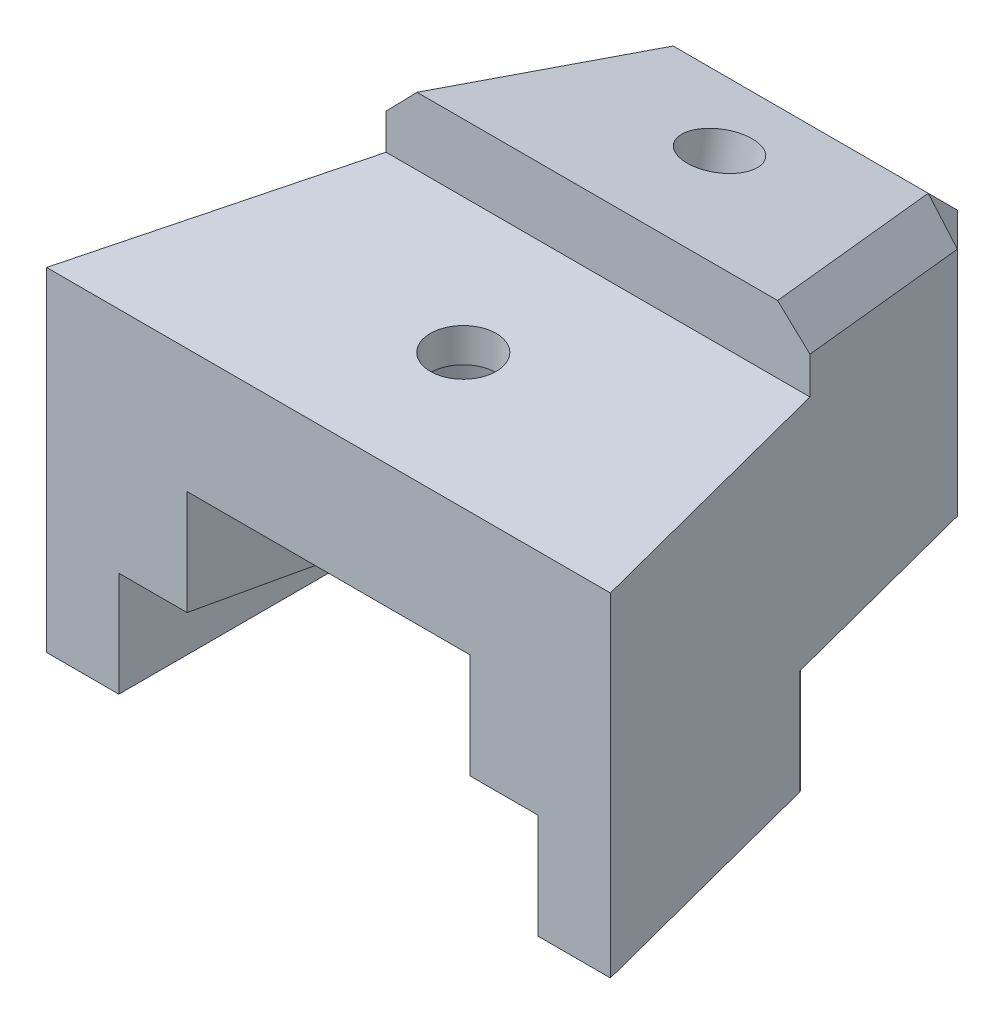
ISO-10303-21;
HEADER;
FILE_DESCRIPTION(('STEP AP214'),'2;1');
FILE_NAME('part.step','',(''),(''),'','','');
FILE_SCHEMA(('AUTOMOTIVE_DESIGN { 1 0 10303 214 1 1 1 1 }'));
ENDSEC;
DATA;
#1=APPLICATION_CONTEXT('core data for automotive mechanical design processes');
#2=APPLICATION_PROTOCOL_DEFINITION('international standard','automotive_design',2000,#1);
#3=PRODUCT_CONTEXT('',#1,'mechanical');
#4=PRODUCT('Part','Part','',(#3));
#5=PRODUCT_RELATED_PRODUCT_CATEGORY('part','',(#4));
#6=PRODUCT_DEFINITION_FORMATION('','',#4);
#7=PRODUCT_DEFINITION_CONTEXT('part definition',#1,'design');
#8=PRODUCT_DEFINITION('design','',#6,#7);
#9=PRODUCT_DEFINITION_SHAPE('','',#8);
#10=(LENGTH_UNIT() NAMED_UNIT(*) SI_UNIT(.MILLI.,.METRE.));
#11=(NAMED_UNIT(*) PLANE_ANGLE_UNIT() SI_UNIT($,.RADIAN.));
#12=(NAMED_UNIT(*) SI_UNIT($,.STERADIAN.) SOLID_ANGLE_UNIT());
#13=UNCERTAINTY_MEASURE_WITH_UNIT(LENGTH_MEASURE(1.E-05),#10,'distance_accuracy_value','');
#14=(GEOMETRIC_REPRESENTATION_CONTEXT(3) GLOBAL_UNCERTAINTY_ASSIGNED_CONTEXT((#13)) GLOBAL_UNIT_ASSIGNED_CONTEXT((#10,
#11,#12)) REPRESENTATION_CONTEXT('',''));
#15=CARTESIAN_POINT('',(0.,0.,0.));
#16=DIRECTION('',(0.,0.,1.));
#17=DIRECTION('',(1.,0.,0.));
#18=AXIS2_PLACEMENT_3D('',#15,#16,#17);
#19=CARTESIAN_POINT('',(19.8529411764706,0.,-4.41176470588235));
#20=DIRECTION('',(-0.976187060183953,0.,0.216930457818656));
#21=DIRECTION('',(0.216930457818656,0.,0.976187060183953));
#22=AXIS2_PLACEMENT_3D('',#19,#20,#21);
#23=PLANE('',#22);
#24=DIRECTION('',(0.216930457818656,0.,0.976187060183953));
#25=VECTOR('',#24,1.);
#26=CARTESIAN_POINT('',(19.8529411764706,3.5,-4.41176470588235));
#27=LINE('',#26,#25);
#28=CARTESIAN_POINT('',(2.72222222222222,3.5,-81.5));
#29=VERTEX_POINT('',#28);
#30=CARTESIAN_POINT('',(4.72222222222222,3.5,-72.5));
#31=VERTEX_POINT('',#30);
#32=EDGE_CURVE('E216',#29,#31,#27,.T.);
#33=ORIENTED_EDGE('',*,*,#32,.F.);
#34=DIRECTION('',(-0.060935691556374,-0.959737142012912,-0.274210612003683));
#35=VECTOR('',#34,1.);
#36=CARTESIAN_POINT('',(3.869227198886,21.5653283824549,-76.338477605013));
#37=LINE('',#36,#35);
#38=CARTESIAN_POINT('',(2.5,0.,-82.5));
#39=VERTEX_POINT('',#38);
#40=EDGE_CURVE('E187',#29,#39,#37,.T.);
#41=ORIENTED_EDGE('',*,*,#40,.T.);
#42=DIRECTION('',(-0.216930457818656,0.,-0.976187060183953));
#43=VECTOR('',#42,1.);
#44=CARTESIAN_POINT('',(19.8529411764706,0.,-4.41176470588235));
#45=LINE('',#44,#43);
#46=CARTESIAN_POINT('',(4.72222222222222,0.,-72.5));
#47=VERTEX_POINT('',#46);
#48=EDGE_CURVE('E278',#47,#39,#45,.T.);
#49=ORIENTED_EDGE('',*,*,#48,.F.);
#50=DIRECTION('',(0.,-1.,0.));
#51=VECTOR('',#50,1.);
#52=CARTESIAN_POINT('',(4.72222222222222,0.,-72.5));
#53=LINE('',#52,#51);
#54=EDGE_CURVE('E222',#31,#47,#53,.T.);
#55=ORIENTED_EDGE('',*,*,#54,.F.);
#56=EDGE_LOOP('',(#33,#41,#49,#55));
#57=FACE_BOUND('',#56,.T.);
#58=ADVANCED_FACE('F39',(#57),#23,.T.);
#59=CARTESIAN_POINT('',(-19.8529411764706,0.,-4.41176470588236));
#60=DIRECTION('',(0.976187060183953,0.,0.216930457818656));
#61=DIRECTION('',(0.216930457818656,0.,-0.976187060183953));
#62=AXIS2_PLACEMENT_3D('',#59,#60,#61);
#63=PLANE('',#62);
#64=DIRECTION('',(-0.216930457818656,0.,0.976187060183953));
#65=VECTOR('',#64,1.);
#66=CARTESIAN_POINT('',(-19.8529411764706,0.,-4.41176470588236));
#67=LINE('',#66,#65);
#68=CARTESIAN_POINT('',(-2.5,0.,-82.4999999999999));
#69=VERTEX_POINT('',#68);
#70=CARTESIAN_POINT('',(-4.72222222222222,0.,-72.5));
#71=VERTEX_POINT('',#70);
#72=EDGE_CURVE('E323',#69,#71,#67,.T.);
#73=ORIENTED_EDGE('',*,*,#72,.F.);
#74=DIRECTION('',(-0.0609356915563738,0.959737142012912,0.274210612003681));
#75=VECTOR('',#74,1.);
#76=CARTESIAN_POINT('',(-3.86922719888599,21.5653283824548,-76.338477605013));
#77=LINE('',#76,#75);
#78=CARTESIAN_POINT('',(-2.72222222222222,3.5,-81.5));
#79=VERTEX_POINT('',#78);
#80=EDGE_CURVE('E197',#69,#79,#77,.T.);
#81=ORIENTED_EDGE('',*,*,#80,.T.);
#82=DIRECTION('',(0.216930457818656,0.,-0.976187060183953));
#83=VECTOR('',#82,1.);
#84=CARTESIAN_POINT('',(-19.8529411764706,3.5,-4.41176470588236));
#85=LINE('',#84,#83);
#86=CARTESIAN_POINT('',(-4.72222222222222,3.5,-72.5));
#87=VERTEX_POINT('',#86);
#88=EDGE_CURVE('E219',#87,#79,#85,.T.);
#89=ORIENTED_EDGE('',*,*,#88,.F.);
#90=DIRECTION('',(0.,1.,0.));
#91=VECTOR('',#90,1.);
#92=CARTESIAN_POINT('',(-4.72222222222222,0.,-72.5));
#93=LINE('',#92,#91);
#94=EDGE_CURVE('E227',#71,#87,#93,.T.);
#95=ORIENTED_EDGE('',*,*,#94,.F.);
#96=EDGE_LOOP('',(#73,#81,#89,#95));
#97=FACE_BOUND('',#96,.T.);
#98=ADVANCED_FACE('F378',(#97),#63,.T.);
#99=CARTESIAN_POINT('',(0.,-10.2457850498689,-82.1960680330738));
#100=DIRECTION('',(0.,0.985350505855448,-0.170541433705751));
#101=DIRECTION('',(0.,0.170541433705751,0.985350505855448));
#102=AXIS2_PLACEMENT_3D('',#99,#100,#101);
#103=CYLINDRICAL_SURFACE('',#102,1.1);
#104=CARTESIAN_POINT('',(0.,9.18216573482297,-85.5585979765782));
#105=DIRECTION('',(0.,-0.985350505855448,0.170541433705751));
#106=DIRECTION('',(0.,-0.170541433705751,-0.985350505855448));
#107=AXIS2_PLACEMENT_3D('',#104,#105,#106);
#108=CIRCLE('',#107,1.1);
#109=CARTESIAN_POINT('',(0.,8.99457015774664,-86.6424835330192));
#110=VERTEX_POINT('',#109);
#111=EDGE_CURVE('E388',#110,#110,#108,.T.);
#112=ORIENTED_EDGE('',*,*,#111,.F.);
#113=EDGE_LOOP('',(#112));
#114=FACE_BOUND('',#113,.T.);
#115=CARTESIAN_POINT('',(0.,4.16666666666666,-84.6905308301665));
#116=DIRECTION('',(0.,-1.,0.));
#117=DIRECTION('',(0.,0.,-1.));
#118=AXIS2_PLACEMENT_3D('',#115,#116,#117);
#119=ELLIPSE('',#118,1.1163540217042,1.1);
#120=CARTESIAN_POINT('',(0.,4.16666666666666,-85.8068848518707));
#121=VERTEX_POINT('',#120);
#122=EDGE_CURVE('E198',#121,#121,#119,.T.);
#123=ORIENTED_EDGE('',*,*,#122,.T.);
#124=EDGE_LOOP('',(#123));
#125=FACE_BOUND('',#124,.T.);
#126=ADVANCED_FACE('F505',(#114,#125),#103,.F.);
#127=CARTESIAN_POINT('',(-7.,-3.5,-89.5));
#128=DIRECTION('',(0.,1.,0.));
#129=DIRECTION('',(0.,0.,1.));
#130=AXIS2_PLACEMENT_3D('',#127,#128,#129);
#131=PLANE('',#130);
#132=DIRECTION('',(0.251285133416822,0.,-0.967913106494426));
#133=VECTOR('',#132,1.);
#134=CARTESIAN_POINT('',(-26.4526634906886,-3.5,-6.86751840623647));
#135=LINE('',#134,#133);
#136=CARTESIAN_POINT('',(-9.41346153846153,-3.5,-72.5));
#137=VERTEX_POINT('',#136);
#138=CARTESIAN_POINT('',(-7.19679131064943,-3.5,-81.0382853219429));
#139=VERTEX_POINT('',#138);
#140=EDGE_CURVE('E257',#137,#139,#135,.T.);
#141=ORIENTED_EDGE('',*,*,#140,.T.);
#142=CARTESIAN_POINT('',(-7.1,-3.5,-81.0131568086012));
#143=DIRECTION('',(0.,1.,0.));
#144=DIRECTION('',(0.,0.,1.));
#145=AXIS2_PLACEMENT_3D('',#142,#143,#144);
#146=CIRCLE('',#145,0.1);
#147=CARTESIAN_POINT('',(-7.,-3.5,-81.0131568086012));
#148=VERTEX_POINT('',#147);
#149=EDGE_CURVE('E343',#139,#148,#146,.F.);
#150=ORIENTED_EDGE('',*,*,#149,.T.);
#151=DIRECTION('',(0.,0.,1.));
#152=VECTOR('',#151,1.);
#153=CARTESIAN_POINT('',(-7.,-3.5,-89.5));
#154=LINE('',#153,#152);
#155=CARTESIAN_POINT('',(-7.,-3.5,-72.5));
#156=VERTEX_POINT('',#155);
#157=EDGE_CURVE('E298',#148,#156,#154,.T.);
#158=ORIENTED_EDGE('',*,*,#157,.T.);
#159=DIRECTION('',(-1.,0.,0.));
#160=VECTOR('',#159,1.);
#161=CARTESIAN_POINT('',(-7.,-3.5,-72.5));
#162=LINE('',#161,#160);
#163=EDGE_CURVE('E299',#156,#137,#162,.T.);
#164=ORIENTED_EDGE('',*,*,#163,.T.);
#165=EDGE_LOOP('',(#141,#150,#158,#164));
#166=FACE_BOUND('',#165,.T.);
#167=ADVANCED_FACE('F365',(#166),#131,.F.);
#168=CARTESIAN_POINT('',(0.,7.63461538461537,-72.5));
#169=DIRECTION('',(0.,-1.,0.));
#170=DIRECTION('',(0.,0.,-1.));
#171=AXIS2_PLACEMENT_3D('',#168,#169,#170);
#172=PLANE('',#171);
#173=DIRECTION('',(-0.251285133416822,0.,-0.967913106494426));
#174=VECTOR('',#173,1.);
#175=CARTESIAN_POINT('',(26.4526634906886,7.63461538461537,-6.86751840623647));
#176=LINE('',#175,#174);
#177=CARTESIAN_POINT('',(9.41346153846153,7.63461538461537,-72.5));
#178=VERTEX_POINT('',#177);
#179=CARTESIAN_POINT('',(7.07692307692307,7.63461538461537,-81.5));
#180=VERTEX_POINT('',#179);
#181=EDGE_CURVE('E320',#178,#180,#176,.T.);
#182=ORIENTED_EDGE('',*,*,#181,.T.);
#183=DIRECTION('',(1.,0.,0.));
#184=VECTOR('',#183,1.);
#185=CARTESIAN_POINT('',(0.,7.63461538461537,-81.5));
#186=LINE('',#185,#184);
#187=CARTESIAN_POINT('',(-7.07692307692307,7.63461538461537,-81.5));
#188=VERTEX_POINT('',#187);
#189=EDGE_CURVE('E311',#188,#180,#186,.T.);
#190=ORIENTED_EDGE('',*,*,#189,.F.);
#191=DIRECTION('',(-0.251285133416822,0.,0.967913106494426));
#192=VECTOR('',#191,1.);
#193=CARTESIAN_POINT('',(-26.4526634906886,7.63461538461537,-6.86751840623647));
#194=LINE('',#193,#192);
#195=CARTESIAN_POINT('',(-9.41346153846153,7.63461538461537,-72.5));
#196=VERTEX_POINT('',#195);
#197=EDGE_CURVE('E317',#188,#196,#194,.T.);
#198=ORIENTED_EDGE('',*,*,#197,.T.);
#199=DIRECTION('',(1.,0.,0.));
#200=VECTOR('',#199,1.);
#201=CARTESIAN_POINT('',(0.,7.63461538461537,-72.5));
#202=LINE('',#201,#200);
#203=EDGE_CURVE('E302',#196,#178,#202,.T.);
#204=ORIENTED_EDGE('',*,*,#203,.T.);
#205=EDGE_LOOP('',(#182,#190,#198,#204));
#206=FACE_BOUND('',#205,.T.);
#207=CARTESIAN_POINT('',(0.,7.63461538461537,-77.));
#208=DIRECTION('',(0.,-1.,0.));
#209=DIRECTION('',(0.,0.,-1.));
#210=AXIS2_PLACEMENT_3D('',#207,#208,#209);
#211=CIRCLE('',#210,1.1);
#212=CARTESIAN_POINT('',(0.,7.63461538461537,-78.1));
#213=VERTEX_POINT('',#212);
#214=EDGE_CURVE('E223',#213,#213,#211,.F.);
#215=ORIENTED_EDGE('',*,*,#214,.F.);
#216=EDGE_LOOP('',(#215));
#217=FACE_BOUND('',#216,.T.);
#218=ADVANCED_FACE('F535',(#206,#217),#172,.F.);
#219=CARTESIAN_POINT('',(0.,7.63461538461537,-81.5));
#220=DIRECTION('',(0.,0.,-1.));
#221=DIRECTION('',(-1.,0.,0.));
#222=AXIS2_PLACEMENT_3D('',#219,#220,#221);
#223=PLANE('',#222);
#224=DIRECTION('',(0.,-1.,0.));
#225=VECTOR('',#224,1.);
#226=CARTESIAN_POINT('',(-7.07692307692307,0.,-81.5));
#227=LINE('',#226,#225);
#228=CARTESIAN_POINT('',(-7.07692307692307,8.8242655163756,-81.5));
#229=VERTEX_POINT('',#228);
#230=EDGE_CURVE('E265',#229,#188,#227,.T.);
#231=ORIENTED_EDGE('',*,*,#230,.T.);
#232=ORIENTED_EDGE('',*,*,#189,.T.);
#233=DIRECTION('',(0.,1.,0.));
#234=VECTOR('',#233,1.);
#235=CARTESIAN_POINT('',(7.07692307692307,0.,-81.5));
#236=LINE('',#235,#234);
#237=CARTESIAN_POINT('',(7.07692307692308,8.87068042762272,-81.5));
#238=VERTEX_POINT('',#237);
#239=EDGE_CURVE('E271',#180,#238,#236,.T.);
#240=ORIENTED_EDGE('',*,*,#239,.T.);
#241=DIRECTION('',(0.728880498059279,-0.684640942062961,0.));
#242=VECTOR('',#241,1.);
#243=CARTESIAN_POINT('',(9.67297176800619,6.43219946093905,-81.5));
#244=LINE('',#243,#242);
#245=CARTESIAN_POINT('',(5.99747051858549,9.88461538461537,-81.5));
#246=VERTEX_POINT('',#245);
#247=EDGE_CURVE('E241',#238,#246,#244,.F.);
#248=ORIENTED_EDGE('',*,*,#247,.T.);
#249=DIRECTION('',(-1.,0.,0.));
#250=VECTOR('',#249,1.);
#251=CARTESIAN_POINT('',(0.,9.88461538461537,-81.5));
#252=LINE('',#251,#250);
#253=CARTESIAN_POINT('',(-6.0447216157861,9.88461538461537,-81.5));
#254=VERTEX_POINT('',#253);
#255=EDGE_CURVE('E262',#246,#254,#252,.T.);
#256=ORIENTED_EDGE('',*,*,#255,.T.);
#257=DIRECTION('',(0.697531875398975,0.716553754300672,0.));
#258=VECTOR('',#257,1.);
#259=CARTESIAN_POINT('',(-9.91145167664684,5.91243857134468,-81.5));
#260=LINE('',#259,#258);
#261=EDGE_CURVE('E260',#254,#229,#260,.F.);
#262=ORIENTED_EDGE('',*,*,#261,.T.);
#263=EDGE_LOOP('',(#231,#232,#240,#248,#256,#262));
#264=FACE_BOUND('',#263,.T.);
#265=ADVANCED_FACE('F542',(#264),#223,.F.);
#266=CARTESIAN_POINT('',(-2.5,0.,-89.5));
#267=DIRECTION('',(0.,1.,0.));
#268=DIRECTION('',(-1.,0.,0.));
#269=AXIS2_PLACEMENT_3D('',#266,#267,#268);
#270=PLANE('',#269);
#271=ORIENTED_EDGE('',*,*,#72,.T.);
#272=DIRECTION('',(-1.,0.,0.));
#273=VECTOR('',#272,1.);
#274=CARTESIAN_POINT('',(-2.5,0.,-72.5));
#275=LINE('',#274,#273);
#276=CARTESIAN_POINT('',(-7.,0.,-72.5));
#277=VERTEX_POINT('',#276);
#278=EDGE_CURVE('E290',#71,#277,#275,.T.);
#279=ORIENTED_EDGE('',*,*,#278,.T.);
#280=DIRECTION('',(0.,0.,1.));
#281=VECTOR('',#280,1.);
#282=CARTESIAN_POINT('',(-7.,0.,-89.5));
#283=LINE('',#282,#281);
#284=CARTESIAN_POINT('',(-7.,0.,-81.0131568086012));
#285=VERTEX_POINT('',#284);
#286=EDGE_CURVE('E293',#285,#277,#283,.T.);
#287=ORIENTED_EDGE('',*,*,#286,.F.);
#288=CARTESIAN_POINT('',(-7.1,0.,-81.0131568086012));
#289=DIRECTION('',(0.,1.,0.));
#290=DIRECTION('',(-1.,0.,0.));
#291=AXIS2_PLACEMENT_3D('',#288,#289,#290);
#292=CIRCLE('',#291,0.1);
#293=CARTESIAN_POINT('',(-7.19679131064944,0.,-81.0382853219429));
#294=VERTEX_POINT('',#293);
#295=EDGE_CURVE('E47',#285,#294,#292,.T.);
#296=ORIENTED_EDGE('',*,*,#295,.T.);
#297=DIRECTION('',(0.251285133416822,0.,-0.967913106494426));
#298=VECTOR('',#297,1.);
#299=CARTESIAN_POINT('',(-26.4526634906886,0.,-6.86751840623647));
#300=LINE('',#299,#298);
#301=CARTESIAN_POINT('',(-5.35064935064934,0.,-88.1493506493507));
#302=VERTEX_POINT('',#301);
#303=EDGE_CURVE('E261',#294,#302,#300,.T.);
#304=ORIENTED_EDGE('',*,*,#303,.T.);
#305=DIRECTION('',(-0.707106781186547,0.,0.707106781186548));
#306=VECTOR('',#305,1.);
#307=CARTESIAN_POINT('',(-5.35064935064934,0.,-88.1493506493507));
#308=LINE('',#307,#306);
#309=CARTESIAN_POINT('',(-4.,0.,-89.5));
#310=VERTEX_POINT('',#309);
#311=EDGE_CURVE('E238',#302,#310,#308,.F.);
#312=ORIENTED_EDGE('',*,*,#311,.T.);
#313=DIRECTION('',(1.,0.,0.));
#314=VECTOR('',#313,1.);
#315=CARTESIAN_POINT('',(0.,0.,-89.5));
#316=LINE('',#315,#314);
#317=CARTESIAN_POINT('',(-2.5,0.,-89.5));
#318=VERTEX_POINT('',#317);
#319=EDGE_CURVE('E269',#310,#318,#316,.T.);
#320=ORIENTED_EDGE('',*,*,#319,.T.);
#321=DIRECTION('',(0.,0.,1.));
#322=VECTOR('',#321,1.);
#323=CARTESIAN_POINT('',(-2.5,0.,-89.5));
#324=LINE('',#323,#322);
#325=EDGE_CURVE('E294',#318,#69,#324,.T.);
#326=ORIENTED_EDGE('',*,*,#325,.T.);
#327=EDGE_LOOP('',(#271,#279,#287,#296,#304,#312,#320,#326));
#328=FACE_BOUND('',#327,.T.);
#329=ADVANCED_FACE('F354',(#328),#270,.F.);
#330=CARTESIAN_POINT('',(7.,0.,-89.5));
#331=DIRECTION('',(0.,1.,0.));
#332=DIRECTION('',(-1.,0.,0.));
#333=AXIS2_PLACEMENT_3D('',#330,#331,#332);
#334=PLANE('',#333);
#335=ORIENTED_EDGE('',*,*,#48,.T.);
#336=DIRECTION('',(0.,0.,1.));
#337=VECTOR('',#336,1.);
#338=CARTESIAN_POINT('',(2.5,0.,-89.5));
#339=LINE('',#338,#337);
#340=CARTESIAN_POINT('',(2.5,0.,-89.5));
#341=VERTEX_POINT('',#340);
#342=EDGE_CURVE('E289',#341,#39,#339,.T.);
#343=ORIENTED_EDGE('',*,*,#342,.F.);
#344=DIRECTION('',(1.,0.,0.));
#345=VECTOR('',#344,1.);
#346=CARTESIAN_POINT('',(0.,0.,-89.5));
#347=LINE('',#346,#345);
#348=CARTESIAN_POINT('',(4.00000000000004,0.,-89.5));
#349=VERTEX_POINT('',#348);
#350=EDGE_CURVE('E275',#341,#349,#347,.T.);
#351=ORIENTED_EDGE('',*,*,#350,.T.);
#352=DIRECTION('',(-0.707106781186543,0.,-0.707106781186553));
#353=VECTOR('',#352,1.);
#354=CARTESIAN_POINT('',(5.35064935064934,0.,-88.1493506493507));
#355=LINE('',#354,#353);
#356=CARTESIAN_POINT('',(5.35064935064934,0.,-88.1493506493507));
#357=VERTEX_POINT('',#356);
#358=EDGE_CURVE('E235',#349,#357,#355,.F.);
#359=ORIENTED_EDGE('',*,*,#358,.T.);
#360=DIRECTION('',(0.251285133416822,0.,0.967913106494426));
#361=VECTOR('',#360,1.);
#362=CARTESIAN_POINT('',(26.4526634906886,0.,-6.86751840623647));
#363=LINE('',#362,#361);
#364=CARTESIAN_POINT('',(7.19679131064944,0.,-81.0382853219429));
#365=VERTEX_POINT('',#364);
#366=EDGE_CURVE('E53',#357,#365,#363,.T.);
#367=ORIENTED_EDGE('',*,*,#366,.T.);
#368=CARTESIAN_POINT('',(7.1,0.,-81.0131568086012));
#369=DIRECTION('',(0.,1.,0.));
#370=DIRECTION('',(-1.,0.,0.));
#371=AXIS2_PLACEMENT_3D('',#368,#369,#370);
#372=CIRCLE('',#371,0.1);
#373=CARTESIAN_POINT('',(7.,0.,-81.0131568086012));
#374=VERTEX_POINT('',#373);
#375=EDGE_CURVE('E11',#365,#374,#372,.T.);
#376=ORIENTED_EDGE('',*,*,#375,.T.);
#377=DIRECTION('',(0.,0.,1.));
#378=VECTOR('',#377,1.);
#379=CARTESIAN_POINT('',(7.,0.,-89.5));
#380=LINE('',#379,#378);
#381=CARTESIAN_POINT('',(7.,0.,-72.5));
#382=VERTEX_POINT('',#381);
#383=EDGE_CURVE('E285',#374,#382,#380,.T.);
#384=ORIENTED_EDGE('',*,*,#383,.T.);
#385=DIRECTION('',(-1.,0.,0.));
#386=VECTOR('',#385,1.);
#387=CARTESIAN_POINT('',(7.,0.,-72.5));
#388=LINE('',#387,#386);
#389=EDGE_CURVE('E286',#382,#47,#388,.T.);
#390=ORIENTED_EDGE('',*,*,#389,.T.);
#391=EDGE_LOOP('',(#335,#343,#351,#359,#367,#376,#384,#390));
#392=FACE_BOUND('',#391,.T.);
#393=ADVANCED_FACE('F541',(#392),#334,.F.);
#394=CARTESIAN_POINT('',(7.,-3.5,-89.5));
#395=DIRECTION('',(1.,0.,0.));
#396=DIRECTION('',(0.,1.,0.));
#397=AXIS2_PLACEMENT_3D('',#394,#395,#396);
#398=PLANE('',#397);
#399=ORIENTED_EDGE('',*,*,#383,.F.);
#400=DIRECTION('',(0.,-1.,0.));
#401=VECTOR('',#400,1.);
#402=CARTESIAN_POINT('',(7.,-3.5,-81.0131568086012));
#403=LINE('',#402,#401);
#404=CARTESIAN_POINT('',(7.,-3.5,-81.0131568086012));
#405=VERTEX_POINT('',#404);
#406=EDGE_CURVE('E345',#374,#405,#403,.T.);
#407=ORIENTED_EDGE('',*,*,#406,.T.);
#408=DIRECTION('',(0.,0.,1.));
#409=VECTOR('',#408,1.);
#410=CARTESIAN_POINT('',(7.,-3.5,-89.5));
#411=LINE('',#410,#409);
#412=CARTESIAN_POINT('',(7.,-3.5,-72.5));
#413=VERTEX_POINT('',#412);
#414=EDGE_CURVE('E281',#405,#413,#411,.T.);
#415=ORIENTED_EDGE('',*,*,#414,.T.);
#416=DIRECTION('',(0.,1.,0.));
#417=VECTOR('',#416,1.);
#418=CARTESIAN_POINT('',(7.,-3.5,-72.5));
#419=LINE('',#418,#417);
#420=EDGE_CURVE('E282',#413,#382,#419,.T.);
#421=ORIENTED_EDGE('',*,*,#420,.T.);
#422=EDGE_LOOP('',(#399,#407,#415,#421));
#423=FACE_BOUND('',#422,.T.);
#424=ADVANCED_FACE('F545',(#423),#398,.F.);
#425=CARTESIAN_POINT('',(0.,0.,-89.5));
#426=DIRECTION('',(0.,0.,1.));
#427=DIRECTION('',(1.,0.,0.));
#428=AXIS2_PLACEMENT_3D('',#425,#426,#427);
#429=CYLINDRICAL_SURFACE('',#428,2.5);
#430=DIRECTION('',(0.,0.,1.));
#431=VECTOR('',#430,1.);
#432=CARTESIAN_POINT('',(-2.5,0.,-98.1073468474952));
#433=LINE('',#432,#431);
#434=CARTESIAN_POINT('',(-2.5,0.,-81.5));
#435=VERTEX_POINT('',#434);
#436=EDGE_CURVE('E462',#69,#435,#433,.T.);
#437=ORIENTED_EDGE('',*,*,#436,.F.);
#438=ORIENTED_EDGE('',*,*,#325,.F.);
#439=CARTESIAN_POINT('',(0.,0.,-89.5));
#440=DIRECTION('',(0.,0.,-1.));
#441=DIRECTION('',(-1.,0.,0.));
#442=AXIS2_PLACEMENT_3D('',#439,#440,#441);
#443=CIRCLE('',#442,2.5);
#444=EDGE_CURVE('E272',#318,#341,#443,.F.);
#445=ORIENTED_EDGE('',*,*,#444,.T.);
#446=ORIENTED_EDGE('',*,*,#342,.T.);
#447=DIRECTION('',(0.,0.,1.));
#448=VECTOR('',#447,1.);
#449=CARTESIAN_POINT('',(2.5,0.,-98.1073468474952));
#450=LINE('',#449,#448);
#451=CARTESIAN_POINT('',(2.5,0.,-81.5));
#452=VERTEX_POINT('',#451);
#453=EDGE_CURVE('E192',#39,#452,#450,.T.);
#454=ORIENTED_EDGE('',*,*,#453,.T.);
#455=CARTESIAN_POINT('',(0.,0.,-81.5));
#456=DIRECTION('',(0.,0.,-1.));
#457=DIRECTION('',(1.,0.,0.));
#458=AXIS2_PLACEMENT_3D('',#455,#456,#457);
#459=CIRCLE('',#458,2.5);
#460=EDGE_CURVE('E208',#452,#435,#459,.T.);
#461=ORIENTED_EDGE('',*,*,#460,.T.);
#462=EDGE_LOOP('',(#437,#438,#445,#446,#454,#461));
#463=FACE_BOUND('',#462,.T.);
#464=ADVANCED_FACE('F461',(#463),#429,.T.);
#465=CARTESIAN_POINT('',(-7.,0.,-89.5));
#466=DIRECTION('',(-1.,0.,0.));
#467=DIRECTION('',(0.,-1.,0.));
#468=AXIS2_PLACEMENT_3D('',#465,#466,#467);
#469=PLANE('',#468);
#470=ORIENTED_EDGE('',*,*,#157,.F.);
#471=DIRECTION('',(0.,1.,0.));
#472=VECTOR('',#471,1.);
#473=CARTESIAN_POINT('',(-7.,0.,-81.0131568086012));
#474=LINE('',#473,#472);
#475=EDGE_CURVE('E314',#148,#285,#474,.T.);
#476=ORIENTED_EDGE('',*,*,#475,.T.);
#477=ORIENTED_EDGE('',*,*,#286,.T.);
#478=DIRECTION('',(0.,-1.,0.));
#479=VECTOR('',#478,1.);
#480=CARTESIAN_POINT('',(-7.,0.,-72.5));
#481=LINE('',#480,#479);
#482=EDGE_CURVE('E295',#277,#156,#481,.T.);
#483=ORIENTED_EDGE('',*,*,#482,.T.);
#484=EDGE_LOOP('',(#470,#476,#477,#483));
#485=FACE_BOUND('',#484,.T.);
#486=ADVANCED_FACE('F374',(#485),#469,.F.);
#487=CARTESIAN_POINT('',(10.,-3.5,-89.5));
#488=DIRECTION('',(0.,1.,0.));
#489=DIRECTION('',(0.,0.,1.));
#490=AXIS2_PLACEMENT_3D('',#487,#488,#489);
#491=PLANE('',#490);
#492=ORIENTED_EDGE('',*,*,#414,.F.);
#493=CARTESIAN_POINT('',(7.1,-3.5,-81.0131568086012));
#494=DIRECTION('',(0.,1.,0.));
#495=DIRECTION('',(0.,0.,1.));
#496=AXIS2_PLACEMENT_3D('',#493,#494,#495);
#497=CIRCLE('',#496,0.1);
#498=CARTESIAN_POINT('',(7.19679131064944,-3.5,-81.0382853219429));
#499=VERTEX_POINT('',#498);
#500=EDGE_CURVE('E61',#405,#499,#497,.F.);
#501=ORIENTED_EDGE('',*,*,#500,.T.);
#502=DIRECTION('',(0.251285133416822,0.,0.967913106494426));
#503=VECTOR('',#502,1.);
#504=CARTESIAN_POINT('',(26.4526634906886,-3.5,-6.86751840623647));
#505=LINE('',#504,#503);
#506=CARTESIAN_POINT('',(9.41346153846154,-3.5,-72.5));
#507=VERTEX_POINT('',#506);
#508=EDGE_CURVE('E266',#499,#507,#505,.T.);
#509=ORIENTED_EDGE('',*,*,#508,.T.);
#510=DIRECTION('',(-1.,0.,0.));
#511=VECTOR('',#510,1.);
#512=CARTESIAN_POINT('',(10.,-3.5,-72.5));
#513=LINE('',#512,#511);
#514=EDGE_CURVE('E237',#507,#413,#513,.T.);
#515=ORIENTED_EDGE('',*,*,#514,.T.);
#516=EDGE_LOOP('',(#492,#501,#509,#515));
#517=FACE_BOUND('',#516,.T.);
#518=ADVANCED_FACE('F538',(#517),#491,.F.);
#519=CARTESIAN_POINT('',(0.,3.5,-77.));
#520=DIRECTION('',(0.,-1.,0.));
#521=DIRECTION('',(0.,0.,-1.));
#522=AXIS2_PLACEMENT_3D('',#519,#520,#521);
#523=CYLINDRICAL_SURFACE('',#522,1.59999999999999);
#524=CARTESIAN_POINT('',(0.,6.5,-77.));
#525=DIRECTION('',(0.,-1.,0.));
#526=DIRECTION('',(0.,0.,-1.));
#527=AXIS2_PLACEMENT_3D('',#524,#525,#526);
#528=CIRCLE('',#527,1.59999999999999);
#529=CARTESIAN_POINT('',(0.,6.5,-78.6));
#530=VERTEX_POINT('',#529);
#531=EDGE_CURVE('E381',#530,#530,#528,.T.);
#532=ORIENTED_EDGE('',*,*,#531,.F.);
#533=EDGE_LOOP('',(#532));
#534=FACE_BOUND('',#533,.T.);
#535=CARTESIAN_POINT('',(0.,6.87525405104491,-77.));
#536=DIRECTION('',(0.,-1.,0.));
#537=DIRECTION('',(0.,0.,-1.));
#538=AXIS2_PLACEMENT_3D('',#535,#536,#537);
#539=CIRCLE('',#538,1.6);
#540=CARTESIAN_POINT('',(0.,6.87525405104491,-78.6));
#541=VERTEX_POINT('',#540);
#542=EDGE_CURVE('E384',#541,#541,#539,.T.);
#543=ORIENTED_EDGE('',*,*,#542,.T.);
#544=EDGE_LOOP('',(#543));
#545=FACE_BOUND('',#544,.T.);
#546=ADVANCED_FACE('F481',(#534,#545),#523,.T.);
#547=CARTESIAN_POINT('',(0.,6.5,-77.));
#548=DIRECTION('',(0.,1.,0.));
#549=DIRECTION('',(0.,0.,1.));
#550=AXIS2_PLACEMENT_3D('',#547,#548,#549);
#551=PLANE('',#550);
#552=CARTESIAN_POINT('',(0.,6.5,-77.));
#553=DIRECTION('',(0.,-1.,0.));
#554=DIRECTION('',(0.,0.,-1.));
#555=AXIS2_PLACEMENT_3D('',#552,#553,#554);
#556=CIRCLE('',#555,1.1);
#557=CARTESIAN_POINT('',(0.,6.5,-78.1));
#558=VERTEX_POINT('',#557);
#559=EDGE_CURVE('E473',#558,#558,#556,.T.);
#560=ORIENTED_EDGE('',*,*,#559,.F.);
#561=EDGE_LOOP('',(#560));
#562=FACE_BOUND('',#561,.T.);
#563=ORIENTED_EDGE('',*,*,#531,.T.);
#564=EDGE_LOOP('',(#563));
#565=FACE_BOUND('',#564,.T.);
#566=ADVANCED_FACE('F576',(#562,#565),#551,.F.);
#567=CARTESIAN_POINT('',(0.,6.5,-77.));
#568=DIRECTION('',(0.,-1.,0.));
#569=DIRECTION('',(0.,0.,-1.));
#570=AXIS2_PLACEMENT_3D('',#567,#568,#569);
#571=CYLINDRICAL_SURFACE('',#570,1.1);
#572=ORIENTED_EDGE('',*,*,#214,.T.);
#573=EDGE_LOOP('',(#572));
#574=FACE_BOUND('',#573,.T.);
#575=ORIENTED_EDGE('',*,*,#559,.T.);
#576=EDGE_LOOP('',(#575));
#577=FACE_BOUND('',#576,.T.);
#578=ADVANCED_FACE('F486',(#574,#577),#571,.F.);
#579=CARTESIAN_POINT('',(0.,3.5,-77.));
#580=DIRECTION('',(0.,-1.,0.));
#581=DIRECTION('',(0.,0.,-1.));
#582=AXIS2_PLACEMENT_3D('',#579,#580,#581);
#583=CONICAL_SURFACE('',#582,1.925,0.0959931088596883);
#584=ORIENTED_EDGE('',*,*,#542,.F.);
#585=EDGE_LOOP('',(#584));
#586=FACE_BOUND('',#585,.T.);
#587=CARTESIAN_POINT('',(0.,3.5,-77.));
#588=DIRECTION('',(0.,-1.,0.));
#589=DIRECTION('',(0.,0.,-1.));
#590=AXIS2_PLACEMENT_3D('',#587,#588,#589);
#591=CIRCLE('',#590,1.925);
#592=CARTESIAN_POINT('',(0.,3.5,-78.925));
#593=VERTEX_POINT('',#592);
#594=EDGE_CURVE('E476',#593,#593,#591,.T.);
#595=ORIENTED_EDGE('',*,*,#594,.T.);
#596=EDGE_LOOP('',(#595));
#597=FACE_BOUND('',#596,.T.);
#598=ADVANCED_FACE('F483',(#586,#597),#583,.F.);
#599=CARTESIAN_POINT('',(0.,3.5,0.));
#600=DIRECTION('',(0.,-1.,0.));
#601=DIRECTION('',(0.,0.,-1.));
#602=AXIS2_PLACEMENT_3D('',#599,#600,#601);
#603=PLANE('',#602);
#604=ORIENTED_EDGE('',*,*,#594,.F.);
#605=EDGE_LOOP('',(#604));
#606=FACE_BOUND('',#605,.T.);
#607=DIRECTION('',(1.,0.,0.));
#608=VECTOR('',#607,1.);
#609=CARTESIAN_POINT('',(8.33400898012398,3.5,-72.5));
#610=LINE('',#609,#608);
#611=EDGE_CURVE('E220',#87,#31,#610,.T.);
#612=ORIENTED_EDGE('',*,*,#611,.F.);
#613=ORIENTED_EDGE('',*,*,#88,.T.);
#614=DIRECTION('',(-1.,0.,0.));
#615=VECTOR('',#614,1.);
#616=CARTESIAN_POINT('',(-6.04472161578605,3.5,-81.5));
#617=LINE('',#616,#615);
#618=EDGE_CURVE('E205',#29,#79,#617,.T.);
#619=ORIENTED_EDGE('',*,*,#618,.F.);
#620=ORIENTED_EDGE('',*,*,#32,.T.);
#621=EDGE_LOOP('',(#612,#613,#619,#620));
#622=FACE_BOUND('',#621,.T.);
#623=ADVANCED_FACE('F215',(#606,#622),#603,.T.);
#624=CARTESIAN_POINT('',(0.,0.,-84.4544155877284));
#625=DIRECTION('',(0.,0.,-1.));
#626=DIRECTION('',(-1.,0.,0.));
#627=AXIS2_PLACEMENT_3D('',#624,#625,#626);
#628=CYLINDRICAL_SURFACE('',#627,0.9);
#629=CARTESIAN_POINT('',(0.,0.,-89.5));
#630=DIRECTION('',(0.,0.,-1.));
#631=DIRECTION('',(-1.,0.,0.));
#632=AXIS2_PLACEMENT_3D('',#629,#630,#631);
#633=CIRCLE('',#632,0.9);
#634=CARTESIAN_POINT('',(-0.9,0.,-89.5));
#635=VERTEX_POINT('',#634);
#636=EDGE_CURVE('E391',#635,#635,#633,.T.);
#637=ORIENTED_EDGE('',*,*,#636,.T.);
#638=EDGE_LOOP('',(#637));
#639=FACE_BOUND('',#638,.T.);
#640=CARTESIAN_POINT('',(0.,0.,-81.5));
#641=DIRECTION('',(0.,0.,-1.));
#642=DIRECTION('',(-1.,0.,0.));
#643=AXIS2_PLACEMENT_3D('',#640,#641,#642);
#644=CIRCLE('',#643,0.9);
#645=CARTESIAN_POINT('',(-0.9,0.,-81.5));
#646=VERTEX_POINT('',#645);
#647=EDGE_CURVE('E209',#646,#646,#644,.T.);
#648=ORIENTED_EDGE('',*,*,#647,.F.);
#649=EDGE_LOOP('',(#648));
#650=FACE_BOUND('',#649,.T.);
#651=ADVANCED_FACE('F491',(#639,#650),#628,.F.);
#652=CARTESIAN_POINT('',(0.,8.70930232558138,-88.2906976744186));
#653=DIRECTION('',(0.,-0.707106781186552,0.707106781186543));
#654=DIRECTION('',(-1.,0.,0.));
#655=AXIS2_PLACEMENT_3D('',#652,#653,#654);
#656=PLANE('',#655);
#657=DIRECTION('',(-0.162555631281753,0.697701822678778,0.697701822678787));
#658=VECTOR('',#657,1.);
#659=CARTESIAN_POINT('',(-4.28175202723511,8.70930232558138,-88.2906976744186));
#660=LINE('',#659,#658);
#661=CARTESIAN_POINT('',(-4.28175202723511,8.70930232558138,-88.2906976744186));
#662=VERTEX_POINT('',#661);
#663=CARTESIAN_POINT('',(-4.00000000000001,7.49999999999999,-89.5));
#664=VERTEX_POINT('',#663);
#665=EDGE_CURVE('E232',#662,#664,#660,.F.);
#666=ORIENTED_EDGE('',*,*,#665,.F.);
#667=DIRECTION('',(-1.,0.,0.));
#668=VECTOR('',#667,1.);
#669=CARTESIAN_POINT('',(0.,8.70930232558138,-88.2906976744186));
#670=LINE('',#669,#668);
#671=CARTESIAN_POINT('',(4.23450093003451,8.70930232558138,-88.2906976744186));
#672=VERTEX_POINT('',#671);
#673=EDGE_CURVE('E246',#672,#662,#670,.T.);
#674=ORIENTED_EDGE('',*,*,#673,.F.);
#675=DIRECTION('',(-0.135846960144374,-0.700551783746041,-0.70055178374605));
#676=VECTOR('',#675,1.);
#677=CARTESIAN_POINT('',(4.00000000000003,7.49999999999999,-89.5));
#678=LINE('',#677,#676);
#679=CARTESIAN_POINT('',(4.00000000000003,7.49999999999999,-89.5));
#680=VERTEX_POINT('',#679);
#681=EDGE_CURVE('E418',#680,#672,#678,.F.);
#682=ORIENTED_EDGE('',*,*,#681,.F.);
#683=DIRECTION('',(1.,0.,0.));
#684=VECTOR('',#683,1.);
#685=CARTESIAN_POINT('',(0.,7.49999999999999,-89.5));
#686=LINE('',#685,#684);
#687=EDGE_CURVE('E397',#664,#680,#686,.T.);
#688=ORIENTED_EDGE('',*,*,#687,.F.);
#689=EDGE_LOOP('',(#666,#674,#682,#688));
#690=FACE_BOUND('',#689,.T.);
#691=ADVANCED_FACE('F415',(#690),#656,.F.);
#692=CARTESIAN_POINT('',(0.,23.2926391382406,-4.03141831238779));
#693=DIRECTION('',(0.,0.985350505855448,-0.170541433705751));
#694=DIRECTION('',(0.,0.170541433705751,0.985350505855448));
#695=AXIS2_PLACEMENT_3D('',#692,#693,#694);
#696=PLANE('',#695);
#697=ORIENTED_EDGE('',*,*,#255,.F.);
#698=DIRECTION('',(-0.247831610581943,-0.165221073721295,-0.954610648167483));
#699=VECTOR('',#698,1.);
#700=CARTESIAN_POINT('',(24.5058470385137,22.2235330645675,-10.2084756269431));
#701=LINE('',#700,#699);
#702=EDGE_CURVE('E242',#246,#672,#701,.T.);
#703=ORIENTED_EDGE('',*,*,#702,.T.);
#704=ORIENTED_EDGE('',*,*,#673,.T.);
#705=DIRECTION('',(-0.247831610581943,0.165221073721295,0.954610648167483));
#706=VECTOR('',#705,1.);
#707=CARTESIAN_POINT('',(-24.5501959493583,22.2215982736635,-10.2196544188329));
#708=LINE('',#707,#706);
#709=EDGE_CURVE('E401',#662,#254,#708,.T.);
#710=ORIENTED_EDGE('',*,*,#709,.T.);
#711=EDGE_LOOP('',(#697,#703,#704,#710));
#712=FACE_BOUND('',#711,.T.);
#713=ORIENTED_EDGE('',*,*,#111,.T.);
#714=EDGE_LOOP('',(#713));
#715=FACE_BOUND('',#714,.T.);
#716=ADVANCED_FACE('F408',(#712,#715),#696,.T.);
#717=CARTESIAN_POINT('',(26.4526634906886,0.,-6.86751840623647));
#718=DIRECTION('',(0.967913106494426,0.,-0.251285133416822));
#719=DIRECTION('',(-0.251285133416822,0.,-0.967913106494426));
#720=AXIS2_PLACEMENT_3D('',#717,#718,#719);
#721=PLANE('',#720);
#722=ORIENTED_EDGE('',*,*,#508,.F.);
#723=DIRECTION('',(0.,-1.,0.));
#724=VECTOR('',#723,1.);
#725=CARTESIAN_POINT('',(7.19679131064944,0.,-81.0382853219429));
#726=LINE('',#725,#724);
#727=EDGE_CURVE('E349',#499,#365,#726,.F.);
#728=ORIENTED_EDGE('',*,*,#727,.T.);
#729=ORIENTED_EDGE('',*,*,#366,.F.);
#730=DIRECTION('',(0.,1.,0.));
#731=VECTOR('',#730,1.);
#732=CARTESIAN_POINT('',(5.35064935064934,0.,-88.1493506493507));
#733=LINE('',#732,#731);
#734=CARTESIAN_POINT('',(5.35064935064934,7.71983127677357,-88.1493506493507));
#735=VERTEX_POINT('',#734);
#736=EDGE_CURVE('E224',#357,#735,#733,.T.);
#737=ORIENTED_EDGE('',*,*,#736,.T.);
#738=DIRECTION('',(0.247831610581943,0.165221073721295,0.954610648167483));
#739=VECTOR('',#738,1.);
#740=CARTESIAN_POINT('',(25.5605166727693,21.1930761581869,-10.3039357789628));
#741=LINE('',#740,#739);
#742=EDGE_CURVE('E229',#735,#238,#741,.T.);
#743=ORIENTED_EDGE('',*,*,#742,.T.);
#744=ORIENTED_EDGE('',*,*,#239,.F.);
#745=ORIENTED_EDGE('',*,*,#181,.F.);
#746=DIRECTION('',(0.,1.,0.));
#747=VECTOR('',#746,1.);
#748=CARTESIAN_POINT('',(9.41346153846154,0.,-72.5));
#749=LINE('',#748,#747);
#750=EDGE_CURVE('E268',#507,#178,#749,.T.);
#751=ORIENTED_EDGE('',*,*,#750,.F.);
#752=EDGE_LOOP('',(#722,#728,#729,#737,#743,#744,#745,#751));
#753=FACE_BOUND('',#752,.T.);
#754=ADVANCED_FACE('F508',(#753),#721,.T.);
#755=CARTESIAN_POINT('',(4.00000000000003,7.49999999999999,-89.5));
#756=DIRECTION('',(0.553430881601431,0.532837174106339,-0.640155297705356));
#757=DIRECTION('',(-0.756490003239714,0.,-0.654005256093847));
#758=AXIS2_PLACEMENT_3D('',#755,#756,#757);
#759=PLANE('',#758);
#760=ORIENTED_EDGE('',*,*,#681,.T.);
#761=DIRECTION('',(-0.744957096419363,0.660408119472907,-0.0943400245319565));
#762=VECTOR('',#761,1.);
#763=CARTESIAN_POINT('',(4.6143205325771,8.37259038517603,-88.242598004258));
#764=LINE('',#763,#762);
#765=EDGE_CURVE('E424',#672,#735,#764,.F.);
#766=ORIENTED_EDGE('',*,*,#765,.T.);
#767=DIRECTION('',(0.702469852360166,0.114333779130046,0.702469852360176));
#768=VECTOR('',#767,1.);
#769=CARTESIAN_POINT('',(4.00000000000003,7.49999999999999,-89.5));
#770=LINE('',#769,#768);
#771=EDGE_CURVE('E379',#680,#735,#770,.T.);
#772=ORIENTED_EDGE('',*,*,#771,.F.);
#773=EDGE_LOOP('',(#760,#766,#772));
#774=FACE_BOUND('',#773,.T.);
#775=ADVANCED_FACE('F430',(#774),#759,.T.);
#776=CARTESIAN_POINT('',(0.,0.,-89.5));
#777=DIRECTION('',(0.,0.,-1.));
#778=DIRECTION('',(-1.,0.,0.));
#779=AXIS2_PLACEMENT_3D('',#776,#777,#778);
#780=PLANE('',#779);
#781=ORIENTED_EDGE('',*,*,#444,.F.);
#782=ORIENTED_EDGE('',*,*,#319,.F.);
#783=DIRECTION('',(0.,1.,0.));
#784=VECTOR('',#783,1.);
#785=CARTESIAN_POINT('',(-4.,0.,-89.5));
#786=LINE('',#785,#784);
#787=EDGE_CURVE('E399',#310,#664,#786,.T.);
#788=ORIENTED_EDGE('',*,*,#787,.T.);
#789=ORIENTED_EDGE('',*,*,#687,.T.);
#790=DIRECTION('',(0.,-1.,0.));
#791=VECTOR('',#790,1.);
#792=CARTESIAN_POINT('',(4.00000000000004,0.,-89.5));
#793=LINE('',#792,#791);
#794=EDGE_CURVE('E394',#680,#349,#793,.T.);
#795=ORIENTED_EDGE('',*,*,#794,.T.);
#796=ORIENTED_EDGE('',*,*,#350,.F.);
#797=EDGE_LOOP('',(#781,#782,#788,#789,#795,#796));
#798=FACE_BOUND('',#797,.T.);
#799=ORIENTED_EDGE('',*,*,#636,.F.);
#800=EDGE_LOOP('',(#799));
#801=FACE_BOUND('',#800,.T.);
#802=ADVANCED_FACE('F455',(#798,#801),#780,.T.);
#803=CARTESIAN_POINT('',(5.35064935064934,0.,-88.1493506493507));
#804=DIRECTION('',(-0.707106781186552,0.,0.707106781186542));
#805=DIRECTION('',(0.,1.,0.));
#806=AXIS2_PLACEMENT_3D('',#803,#804,#805);
#807=PLANE('',#806);
#808=ORIENTED_EDGE('',*,*,#358,.F.);
#809=ORIENTED_EDGE('',*,*,#794,.F.);
#810=ORIENTED_EDGE('',*,*,#771,.T.);
#811=ORIENTED_EDGE('',*,*,#736,.F.);
#812=EDGE_LOOP('',(#808,#809,#810,#811));
#813=FACE_BOUND('',#812,.T.);
#814=ADVANCED_FACE('F452',(#813),#807,.F.);
#815=CARTESIAN_POINT('',(-4.28175202723511,8.70930232558138,-88.2906976744186));
#816=DIRECTION('',(-0.576089872572276,0.506959205982567,-0.641180803041688));
#817=DIRECTION('',(-0.74385508476413,0.,0.668340940591363));
#818=AXIS2_PLACEMENT_3D('',#815,#816,#817);
#819=PLANE('',#818);
#820=DIRECTION('',(-0.714892701230048,-0.692814263754093,0.094534764329735));
#821=VECTOR('',#820,1.);
#822=CARTESIAN_POINT('',(-4.28175202723511,8.70930232558138,-88.2906976744186));
#823=LINE('',#822,#821);
#824=CARTESIAN_POINT('',(-5.35064935064935,7.67341636552644,-88.1493506493507));
#825=VERTEX_POINT('',#824);
#826=EDGE_CURVE('E428',#825,#662,#823,.F.);
#827=ORIENTED_EDGE('',*,*,#826,.T.);
#828=ORIENTED_EDGE('',*,*,#665,.T.);
#829=DIRECTION('',(0.704210469868892,-0.0904169688391937,-0.704210469868893));
#830=VECTOR('',#829,1.);
#831=CARTESIAN_POINT('',(-4.81643171593754,7.6048255943042,-88.6835682840625));
#832=LINE('',#831,#830);
#833=EDGE_CURVE('E433',#825,#664,#832,.T.);
#834=ORIENTED_EDGE('',*,*,#833,.F.);
#835=EDGE_LOOP('',(#827,#828,#834));
#836=FACE_BOUND('',#835,.T.);
#837=ADVANCED_FACE('F441',(#836),#819,.T.);
#838=CARTESIAN_POINT('',(-26.4526634906886,0.,-6.86751840623647));
#839=DIRECTION('',(-0.967913106494426,0.,-0.251285133416822));
#840=DIRECTION('',(-0.251285133416822,0.,0.967913106494426));
#841=AXIS2_PLACEMENT_3D('',#838,#839,#840);
#842=PLANE('',#841);
#843=ORIENTED_EDGE('',*,*,#303,.F.);
#844=DIRECTION('',(0.,1.,0.));
#845=VECTOR('',#844,1.);
#846=CARTESIAN_POINT('',(-7.19679131064944,-3.5,-81.0382853219429));
#847=LINE('',#846,#845);
#848=EDGE_CURVE('E341',#294,#139,#847,.F.);
#849=ORIENTED_EDGE('',*,*,#848,.T.);
#850=ORIENTED_EDGE('',*,*,#140,.F.);
#851=DIRECTION('',(0.,-1.,0.));
#852=VECTOR('',#851,1.);
#853=CARTESIAN_POINT('',(-9.41346153846153,0.,-72.5));
#854=LINE('',#853,#852);
#855=EDGE_CURVE('E319',#196,#137,#854,.T.);
#856=ORIENTED_EDGE('',*,*,#855,.F.);
#857=ORIENTED_EDGE('',*,*,#197,.F.);
#858=ORIENTED_EDGE('',*,*,#230,.F.);
#859=DIRECTION('',(0.247831610581943,-0.165221073721295,-0.954610648167483));
#860=VECTOR('',#859,1.);
#861=CARTESIAN_POINT('',(-25.562417224363,21.1479282813355,-10.2966151357869));
#862=LINE('',#861,#860);
#863=EDGE_CURVE('E245',#229,#825,#862,.T.);
#864=ORIENTED_EDGE('',*,*,#863,.T.);
#865=DIRECTION('',(0.,-1.,0.));
#866=VECTOR('',#865,1.);
#867=CARTESIAN_POINT('',(-5.35064935064934,0.,-88.1493506493507));
#868=LINE('',#867,#866);
#869=EDGE_CURVE('E254',#825,#302,#868,.T.);
#870=ORIENTED_EDGE('',*,*,#869,.T.);
#871=EDGE_LOOP('',(#843,#849,#850,#856,#857,#858,#864,#870));
#872=FACE_BOUND('',#871,.T.);
#873=ADVANCED_FACE('F362',(#872),#842,.T.);
#874=CARTESIAN_POINT('',(-5.35064935064934,0.,-88.1493506493507));
#875=DIRECTION('',(0.707106781186548,0.,0.707106781186547));
#876=DIRECTION('',(0.,-1.,0.));
#877=AXIS2_PLACEMENT_3D('',#874,#875,#876);
#878=PLANE('',#877);
#879=ORIENTED_EDGE('',*,*,#311,.F.);
#880=ORIENTED_EDGE('',*,*,#869,.F.);
#881=ORIENTED_EDGE('',*,*,#833,.T.);
#882=ORIENTED_EDGE('',*,*,#787,.F.);
#883=EDGE_LOOP('',(#879,#880,#881,#882));
#884=FACE_BOUND('',#883,.T.);
#885=ADVANCED_FACE('F445',(#884),#878,.F.);
#886=CARTESIAN_POINT('',(24.5058470385137,22.2235330645675,-10.2084756269431));
#887=DIRECTION('',(-0.655060545018796,-0.697388699649771,0.290765685665417));
#888=DIRECTION('',(-0.247831610581943,-0.165221073721295,-0.954610648167483));
#889=AXIS2_PLACEMENT_3D('',#886,#887,#888);
#890=PLANE('',#889);
#891=ORIENTED_EDGE('',*,*,#247,.F.);
#892=ORIENTED_EDGE('',*,*,#742,.F.);
#893=ORIENTED_EDGE('',*,*,#765,.F.);
#894=ORIENTED_EDGE('',*,*,#702,.F.);
#895=EDGE_LOOP('',(#891,#892,#893,#894));
#896=FACE_BOUND('',#895,.T.);
#897=ADVANCED_FACE('F425',(#896),#890,.F.);
#898=CARTESIAN_POINT('',(-25.562417224363,21.1479282813355,-10.2966151357869));
#899=DIRECTION('',(0.685047258514461,-0.666861761731852,0.293267189337152));
#900=DIRECTION('',(0.247831610581943,-0.165221073721295,-0.954610648167483));
#901=AXIS2_PLACEMENT_3D('',#898,#899,#900);
#902=PLANE('',#901);
#903=ORIENTED_EDGE('',*,*,#261,.F.);
#904=ORIENTED_EDGE('',*,*,#709,.F.);
#905=ORIENTED_EDGE('',*,*,#826,.F.);
#906=ORIENTED_EDGE('',*,*,#863,.F.);
#907=EDGE_LOOP('',(#903,#904,#905,#906));
#908=FACE_BOUND('',#907,.T.);
#909=ADVANCED_FACE('F529',(#908),#902,.F.);
#910=CARTESIAN_POINT('',(8.33400898012398,288600.288756389,-72.5));
#911=DIRECTION('',(0.,0.,-1.));
#912=DIRECTION('',(-1.,0.,0.));
#913=AXIS2_PLACEMENT_3D('',#910,#911,#912);
#914=PLANE('',#913);
#915=ORIENTED_EDGE('',*,*,#611,.T.);
#916=ORIENTED_EDGE('',*,*,#54,.T.);
#917=ORIENTED_EDGE('',*,*,#389,.F.);
#918=ORIENTED_EDGE('',*,*,#420,.F.);
#919=ORIENTED_EDGE('',*,*,#514,.F.);
#920=ORIENTED_EDGE('',*,*,#750,.T.);
#921=ORIENTED_EDGE('',*,*,#203,.F.);
#922=ORIENTED_EDGE('',*,*,#855,.T.);
#923=ORIENTED_EDGE('',*,*,#163,.F.);
#924=ORIENTED_EDGE('',*,*,#482,.F.);
#925=ORIENTED_EDGE('',*,*,#278,.F.);
#926=ORIENTED_EDGE('',*,*,#94,.T.);
#927=EDGE_LOOP('',(#915,#916,#917,#918,#919,#920,#921,#922,#923,#924,#925,#926));
#928=FACE_BOUND('',#927,.T.);
#929=ADVANCED_FACE('F370',(#928),#914,.F.);
#930=CARTESIAN_POINT('',(0.,0.,-81.5));
#931=DIRECTION('',(0.,0.,1.));
#932=DIRECTION('',(1.,0.,0.));
#933=AXIS2_PLACEMENT_3D('',#930,#931,#932);
#934=PLANE('',#933);
#935=DIRECTION('',(-0.0633644731827806,-0.997990452628816,0.));
#936=VECTOR('',#935,1.);
#937=CARTESIAN_POINT('',(2.72222222222222,3.5,-81.5));
#938=LINE('',#937,#936);
#939=EDGE_CURVE('E190',#29,#452,#938,.T.);
#940=ORIENTED_EDGE('',*,*,#939,.F.);
#941=ORIENTED_EDGE('',*,*,#618,.T.);
#942=DIRECTION('',(-0.0633644731827803,0.997990452628816,0.));
#943=VECTOR('',#942,1.);
#944=CARTESIAN_POINT('',(-2.72222222222222,3.5,-81.5));
#945=LINE('',#944,#943);
#946=EDGE_CURVE('E464',#435,#79,#945,.T.);
#947=ORIENTED_EDGE('',*,*,#946,.F.);
#948=ORIENTED_EDGE('',*,*,#460,.F.);
#949=EDGE_LOOP('',(#940,#941,#947,#948));
#950=FACE_BOUND('',#949,.T.);
#951=ORIENTED_EDGE('',*,*,#647,.T.);
#952=EDGE_LOOP('',(#951));
#953=FACE_BOUND('',#952,.T.);
#954=ADVANCED_FACE('F202',(#950,#953),#934,.T.);
#955=CARTESIAN_POINT('',(-2.72222222222222,3.5,-98.1073468474952));
#956=DIRECTION('',(0.997990452628816,0.0633644731827803,0.));
#957=DIRECTION('',(-0.0633644731827803,0.997990452628816,0.));
#958=AXIS2_PLACEMENT_3D('',#955,#956,#957);
#959=PLANE('',#958);
#960=ORIENTED_EDGE('',*,*,#80,.F.);
#961=ORIENTED_EDGE('',*,*,#436,.T.);
#962=ORIENTED_EDGE('',*,*,#946,.T.);
#963=EDGE_LOOP('',(#960,#961,#962));
#964=FACE_BOUND('',#963,.T.);
#965=ADVANCED_FACE('F570',(#964),#959,.F.);
#966=CARTESIAN_POINT('',(2.72222222222222,3.5,-98.1073468474952));
#967=DIRECTION('',(-0.997990452628816,0.0633644731827806,0.));
#968=DIRECTION('',(-0.0633644731827806,-0.997990452628816,0.));
#969=AXIS2_PLACEMENT_3D('',#966,#967,#968);
#970=PLANE('',#969);
#971=ORIENTED_EDGE('',*,*,#40,.F.);
#972=ORIENTED_EDGE('',*,*,#939,.T.);
#973=ORIENTED_EDGE('',*,*,#453,.F.);
#974=EDGE_LOOP('',(#971,#972,#973));
#975=FACE_BOUND('',#974,.T.);
#976=ADVANCED_FACE('F189',(#975),#970,.F.);
#977=CARTESIAN_POINT('',(2.72222222222222,4.16666666666666,-98.1073468474952));
#978=DIRECTION('',(0.,-1.,0.));
#979=DIRECTION('',(1.,0.,0.));
#980=AXIS2_PLACEMENT_3D('',#977,#978,#979);
#981=PLANE('',#980);
#982=ORIENTED_EDGE('',*,*,#122,.F.);
#983=EDGE_LOOP('',(#982));
#984=FACE_BOUND('',#983,.T.);
#985=ADVANCED_FACE('F559',(#984),#981,.F.);
#986=CARTESIAN_POINT('',(-7.1,0.,-81.0131568086012));
#987=DIRECTION('',(0.,-1.,0.));
#988=DIRECTION('',(1.,0.,0.));
#989=AXIS2_PLACEMENT_3D('',#986,#987,#988);
#990=CYLINDRICAL_SURFACE('',#989,0.1);
#991=ORIENTED_EDGE('',*,*,#149,.F.);
#992=ORIENTED_EDGE('',*,*,#848,.F.);
#993=ORIENTED_EDGE('',*,*,#295,.F.);
#994=ORIENTED_EDGE('',*,*,#475,.F.);
#995=EDGE_LOOP('',(#991,#992,#993,#994));
#996=FACE_BOUND('',#995,.T.);
#997=ADVANCED_FACE('F359',(#996),#990,.T.);
#998=CARTESIAN_POINT('',(7.1,-3.50000000000002,-81.0131568086012));
#999=DIRECTION('',(0.,1.,0.));
#1000=DIRECTION('',(0.,0.,1.));
#1001=AXIS2_PLACEMENT_3D('',#998,#999,#1000);
#1002=CYLINDRICAL_SURFACE('',#1001,0.1);
#1003=ORIENTED_EDGE('',*,*,#375,.F.);
#1004=ORIENTED_EDGE('',*,*,#727,.F.);
#1005=ORIENTED_EDGE('',*,*,#500,.F.);
#1006=ORIENTED_EDGE('',*,*,#406,.F.);
#1007=EDGE_LOOP('',(#1003,#1004,#1005,#1006));
#1008=FACE_BOUND('',#1007,.T.);
#1009=ADVANCED_FACE('F41',(#1008),#1002,.T.);
#1010=CLOSED_SHELL('',(#58,#98,#126,#167,#218,#265,#329,#393,#424,#464,#486,#518,#546,#566,#578,
#598,#623,#651,#691,#716,#754,#775,#802,#814,#837,#873,#885,#897,#909,#929,#954,#965,#976,#985,
#997,#1009));
#1011=MANIFOLD_SOLID_BREP('B2',#1010);
#1012=ADVANCED_BREP_SHAPE_REPRESENTATION('',(#18,#1011),#14);
#1013=SHAPE_DEFINITION_REPRESENTATION(#9,#1012);
ENDSEC;
END-ISO-10303-21;
